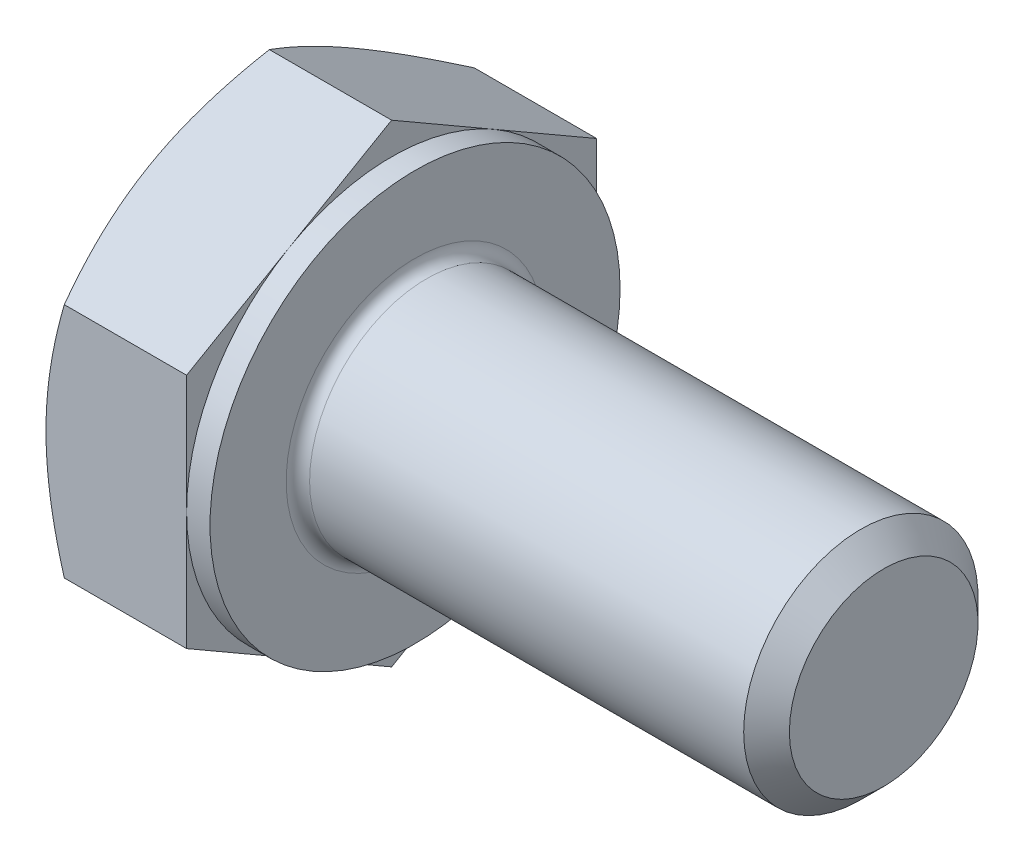
ISO-10303-21;
HEADER;
FILE_DESCRIPTION(('STEP AP214'),'2;1');
FILE_NAME('part.step','',(''),(''),'','','');
FILE_SCHEMA(('AUTOMOTIVE_DESIGN { 1 0 10303 214 1 1 1 1 }'));
ENDSEC;
DATA;
#1=APPLICATION_CONTEXT('core data for automotive mechanical design processes');
#2=APPLICATION_PROTOCOL_DEFINITION('international standard','automotive_design',2000,#1);
#3=PRODUCT_CONTEXT('',#1,'mechanical');
#4=PRODUCT('Part','Part','',(#3));
#5=PRODUCT_RELATED_PRODUCT_CATEGORY('part','',(#4));
#6=PRODUCT_DEFINITION_FORMATION('','',#4);
#7=PRODUCT_DEFINITION_CONTEXT('part definition',#1,'design');
#8=PRODUCT_DEFINITION('design','',#6,#7);
#9=PRODUCT_DEFINITION_SHAPE('','',#8);
#10=(LENGTH_UNIT() NAMED_UNIT(*) SI_UNIT(.MILLI.,.METRE.));
#11=(NAMED_UNIT(*) PLANE_ANGLE_UNIT() SI_UNIT($,.RADIAN.));
#12=(NAMED_UNIT(*) SI_UNIT($,.STERADIAN.) SOLID_ANGLE_UNIT());
#13=UNCERTAINTY_MEASURE_WITH_UNIT(LENGTH_MEASURE(1.E-05),#10,'distance_accuracy_value','');
#14=(GEOMETRIC_REPRESENTATION_CONTEXT(3) GLOBAL_UNCERTAINTY_ASSIGNED_CONTEXT((#13)) GLOBAL_UNIT_ASSIGNED_CONTEXT((#10,
#11,#12)) REPRESENTATION_CONTEXT('',''));
#15=CARTESIAN_POINT('',(0.,0.,0.));
#16=DIRECTION('',(0.,0.,1.));
#17=DIRECTION('',(1.,0.,0.));
#18=AXIS2_PLACEMENT_3D('',#15,#16,#17);
#19=CARTESIAN_POINT('',(2.8,4.04145188432738,0.));
#20=DIRECTION('',(1.,0.,0.));
#21=DIRECTION('',(0.,0.,-1.));
#22=AXIS2_PLACEMENT_3D('',#19,#20,#21);
#23=PLANE('',#22);
#24=CARTESIAN_POINT('',(2.8,0.,0.));
#25=DIRECTION('',(1.,0.,0.));
#26=DIRECTION('',(0.,0.,-1.));
#27=AXIS2_PLACEMENT_3D('',#24,#25,#26);
#28=CIRCLE('',#27,2.2);
#29=CARTESIAN_POINT('',(2.8,0.,-2.2));
#30=VERTEX_POINT('',#29);
#31=EDGE_CURVE('E42',#30,#30,#28,.F.);
#32=ORIENTED_EDGE('',*,*,#31,.T.);
#33=EDGE_LOOP('',(#32));
#34=FACE_BOUND('',#33,.T.);
#35=CARTESIAN_POINT('',(2.8,0.,0.));
#36=DIRECTION('',(1.,0.,0.));
#37=DIRECTION('',(0.,0.,-1.));
#38=AXIS2_PLACEMENT_3D('',#35,#36,#37);
#39=CIRCLE('',#38,3.5);
#40=CARTESIAN_POINT('',(2.8,0.,-3.5));
#41=VERTEX_POINT('',#40);
#42=EDGE_CURVE('E293',#41,#41,#39,.T.);
#43=ORIENTED_EDGE('',*,*,#42,.T.);
#44=EDGE_LOOP('',(#43));
#45=FACE_BOUND('',#44,.T.);
#46=ADVANCED_FACE('F34',(#34,#45),#23,.T.);
#47=CARTESIAN_POINT('',(0.,0.,0.));
#48=DIRECTION('',(-1.,0.,0.));
#49=DIRECTION('',(0.,0.,1.));
#50=AXIS2_PLACEMENT_3D('',#47,#48,#49);
#51=CYLINDRICAL_SURFACE('',#50,2.);
#52=CARTESIAN_POINT('',(3.,0.,0.));
#53=DIRECTION('',(1.,0.,0.));
#54=DIRECTION('',(0.,0.,-1.));
#55=AXIS2_PLACEMENT_3D('',#52,#53,#54);
#56=CIRCLE('',#55,2.);
#57=CARTESIAN_POINT('',(3.,0.,-2.));
#58=VERTEX_POINT('',#57);
#59=EDGE_CURVE('E11',#58,#58,#56,.T.);
#60=ORIENTED_EDGE('',*,*,#59,.T.);
#61=EDGE_LOOP('',(#60));
#62=FACE_BOUND('',#61,.T.);
#63=CARTESIAN_POINT('',(10.41,0.,0.));
#64=DIRECTION('',(-1.,0.,0.));
#65=DIRECTION('',(0.,0.,1.));
#66=AXIS2_PLACEMENT_3D('',#63,#64,#65);
#67=CIRCLE('',#66,2.);
#68=CARTESIAN_POINT('',(10.41,0.,2.));
#69=VERTEX_POINT('',#68);
#70=EDGE_CURVE('E272',#69,#69,#67,.T.);
#71=ORIENTED_EDGE('',*,*,#70,.T.);
#72=EDGE_LOOP('',(#71));
#73=FACE_BOUND('',#72,.T.);
#74=ADVANCED_FACE('F246',(#62,#73),#51,.T.);
#75=CARTESIAN_POINT('',(10.8,0.,0.));
#76=DIRECTION('',(-1.,0.,0.));
#77=DIRECTION('',(0.,0.,1.));
#78=AXIS2_PLACEMENT_3D('',#75,#76,#77);
#79=CONICAL_SURFACE('',#78,1.61,0.78539816339744);
#80=ORIENTED_EDGE('',*,*,#70,.F.);
#81=EDGE_LOOP('',(#80));
#82=FACE_BOUND('',#81,.T.);
#83=CARTESIAN_POINT('',(10.8,0.,0.));
#84=DIRECTION('',(-1.,0.,0.));
#85=DIRECTION('',(0.,0.,1.));
#86=AXIS2_PLACEMENT_3D('',#83,#84,#85);
#87=CIRCLE('',#86,1.61);
#88=CARTESIAN_POINT('',(10.8,0.,1.61));
#89=VERTEX_POINT('',#88);
#90=EDGE_CURVE('E270',#89,#89,#87,.T.);
#91=ORIENTED_EDGE('',*,*,#90,.T.);
#92=EDGE_LOOP('',(#91));
#93=FACE_BOUND('',#92,.T.);
#94=ADVANCED_FACE('F251',(#82,#93),#79,.T.);
#95=CARTESIAN_POINT('',(10.8,0.,0.));
#96=DIRECTION('',(-1.,0.,0.));
#97=DIRECTION('',(0.,0.,1.));
#98=AXIS2_PLACEMENT_3D('',#95,#96,#97);
#99=PLANE('',#98);
#100=ORIENTED_EDGE('',*,*,#90,.F.);
#101=EDGE_LOOP('',(#100));
#102=FACE_BOUND('',#101,.T.);
#103=ADVANCED_FACE('F258',(#102),#99,.F.);
#104=CARTESIAN_POINT('',(2.4,3.5,0.));
#105=DIRECTION('',(1.,0.,0.));
#106=DIRECTION('',(0.,0.,-1.));
#107=AXIS2_PLACEMENT_3D('',#104,#105,#106);
#108=PLANE('',#107);
#109=DIRECTION('',(0.,0.500000000000001,0.866025403784438));
#110=VECTOR('',#109,1.);
#111=CARTESIAN_POINT('',(2.4,2.02072594216369,-3.5));
#112=LINE('',#111,#110);
#113=CARTESIAN_POINT('',(2.4,2.02072594216369,-3.5));
#114=VERTEX_POINT('',#113);
#115=CARTESIAN_POINT('',(2.4,3.03108891324553,-1.75));
#116=VERTEX_POINT('',#115);
#117=EDGE_CURVE('E166',#114,#116,#112,.T.);
#118=ORIENTED_EDGE('',*,*,#117,.T.);
#119=CARTESIAN_POINT('',(2.4,0.,0.));
#120=DIRECTION('',(-1.,0.,0.));
#121=DIRECTION('',(0.,0.,1.));
#122=AXIS2_PLACEMENT_3D('',#119,#120,#121);
#123=CIRCLE('',#122,3.5);
#124=CARTESIAN_POINT('',(2.4,0.,-3.5));
#125=VERTEX_POINT('',#124);
#126=EDGE_CURVE('E49',#116,#125,#123,.T.);
#127=ORIENTED_EDGE('',*,*,#126,.T.);
#128=DIRECTION('',(0.,1.,0.));
#129=VECTOR('',#128,1.);
#130=CARTESIAN_POINT('',(2.4,2.02072594216369,-3.5));
#131=LINE('',#130,#129);
#132=EDGE_CURVE('E296',#125,#114,#131,.T.);
#133=ORIENTED_EDGE('',*,*,#132,.T.);
#134=EDGE_LOOP('',(#118,#127,#133));
#135=FACE_BOUND('',#134,.T.);
#136=ADVANCED_FACE('F261',(#135),#108,.T.);
#137=CARTESIAN_POINT('',(2.4,4.04145188432738,0.));
#138=VERTEX_POINT('',#137);
#139=EDGE_CURVE('E164',#116,#138,#112,.T.);
#140=ORIENTED_EDGE('',*,*,#139,.T.);
#141=DIRECTION('',(0.,-0.500000000000001,0.866025403784438));
#142=VECTOR('',#141,1.);
#143=CARTESIAN_POINT('',(2.4,4.04145188432738,0.));
#144=LINE('',#143,#142);
#145=CARTESIAN_POINT('',(2.4,3.03108891324553,1.75));
#146=VERTEX_POINT('',#145);
#147=EDGE_CURVE('E163',#138,#146,#144,.T.);
#148=ORIENTED_EDGE('',*,*,#147,.T.);
#149=EDGE_CURVE('E152',#146,#116,#123,.T.);
#150=ORIENTED_EDGE('',*,*,#149,.T.);
#151=EDGE_LOOP('',(#140,#148,#150));
#152=FACE_BOUND('',#151,.T.);
#153=ADVANCED_FACE('F266',(#152),#108,.T.);
#154=CARTESIAN_POINT('',(2.4,2.02072594216369,3.5));
#155=VERTEX_POINT('',#154);
#156=EDGE_CURVE('E131',#146,#155,#144,.T.);
#157=ORIENTED_EDGE('',*,*,#156,.T.);
#158=DIRECTION('',(0.,-1.,0.));
#159=VECTOR('',#158,1.);
#160=CARTESIAN_POINT('',(2.4,2.02072594216369,3.5));
#161=LINE('',#160,#159);
#162=CARTESIAN_POINT('',(2.4,0.,3.5));
#163=VERTEX_POINT('',#162);
#164=EDGE_CURVE('E125',#155,#163,#161,.T.);
#165=ORIENTED_EDGE('',*,*,#164,.T.);
#166=EDGE_CURVE('E129',#163,#146,#123,.T.);
#167=ORIENTED_EDGE('',*,*,#166,.T.);
#168=EDGE_LOOP('',(#157,#165,#167));
#169=FACE_BOUND('',#168,.T.);
#170=ADVANCED_FACE('F127',(#169),#108,.T.);
#171=CARTESIAN_POINT('',(2.4,-2.02072594216369,3.5));
#172=VERTEX_POINT('',#171);
#173=EDGE_CURVE('E135',#163,#172,#161,.T.);
#174=ORIENTED_EDGE('',*,*,#173,.T.);
#175=DIRECTION('',(0.,-0.500000000000002,-0.866025403784438));
#176=VECTOR('',#175,1.);
#177=CARTESIAN_POINT('',(2.4,-4.04145188432739,0.));
#178=LINE('',#177,#176);
#179=CARTESIAN_POINT('',(2.4,-3.03108891324553,1.75000000000001));
#180=VERTEX_POINT('',#179);
#181=EDGE_CURVE('E142',#172,#180,#178,.T.);
#182=ORIENTED_EDGE('',*,*,#181,.T.);
#183=EDGE_CURVE('E139',#180,#163,#123,.T.);
#184=ORIENTED_EDGE('',*,*,#183,.T.);
#185=EDGE_LOOP('',(#174,#182,#184));
#186=FACE_BOUND('',#185,.T.);
#187=ADVANCED_FACE('F140',(#186),#108,.T.);
#188=CARTESIAN_POINT('',(2.4,-4.04145188432739,0.));
#189=VERTEX_POINT('',#188);
#190=EDGE_CURVE('E158',#180,#189,#178,.T.);
#191=ORIENTED_EDGE('',*,*,#190,.T.);
#192=DIRECTION('',(0.,0.500000000000001,-0.866025403784438));
#193=VECTOR('',#192,1.);
#194=CARTESIAN_POINT('',(2.4,-2.0207259421637,-3.5));
#195=LINE('',#194,#193);
#196=CARTESIAN_POINT('',(2.4,-3.03108891324553,-1.75));
#197=VERTEX_POINT('',#196);
#198=EDGE_CURVE('E334',#189,#197,#195,.T.);
#199=ORIENTED_EDGE('',*,*,#198,.T.);
#200=EDGE_CURVE('E146',#197,#180,#123,.T.);
#201=ORIENTED_EDGE('',*,*,#200,.T.);
#202=EDGE_LOOP('',(#191,#199,#201));
#203=FACE_BOUND('',#202,.T.);
#204=ADVANCED_FACE('F335',(#203),#108,.T.);
#205=CARTESIAN_POINT('',(2.4,-2.0207259421637,-3.5));
#206=VERTEX_POINT('',#205);
#207=EDGE_CURVE('E153',#197,#206,#195,.T.);
#208=ORIENTED_EDGE('',*,*,#207,.T.);
#209=EDGE_CURVE('E297',#206,#125,#131,.T.);
#210=ORIENTED_EDGE('',*,*,#209,.T.);
#211=EDGE_CURVE('E304',#125,#197,#123,.T.);
#212=ORIENTED_EDGE('',*,*,#211,.T.);
#213=EDGE_LOOP('',(#208,#210,#212));
#214=FACE_BOUND('',#213,.T.);
#215=ADVANCED_FACE('F267',(#214),#108,.T.);
#216=CARTESIAN_POINT('',(0.,0.,0.));
#217=DIRECTION('',(-1.,0.,0.));
#218=DIRECTION('',(0.,0.,1.));
#219=AXIS2_PLACEMENT_3D('',#216,#217,#218);
#220=CYLINDRICAL_SURFACE('',#219,3.5);
#221=ORIENTED_EDGE('',*,*,#126,.F.);
#222=ORIENTED_EDGE('',*,*,#149,.F.);
#223=ORIENTED_EDGE('',*,*,#166,.F.);
#224=ORIENTED_EDGE('',*,*,#183,.F.);
#225=ORIENTED_EDGE('',*,*,#200,.F.);
#226=ORIENTED_EDGE('',*,*,#211,.F.);
#227=EDGE_LOOP('',(#221,#222,#223,#224,#225,#226));
#228=FACE_BOUND('',#227,.T.);
#229=ORIENTED_EDGE('',*,*,#42,.F.);
#230=EDGE_LOOP('',(#229));
#231=FACE_BOUND('',#230,.T.);
#232=ADVANCED_FACE('F149',(#228,#231),#220,.T.);
#233=CARTESIAN_POINT('',(0.,4.04145188432738,0.));
#234=DIRECTION('',(1.,0.,0.));
#235=DIRECTION('',(0.,0.,-1.));
#236=AXIS2_PLACEMENT_3D('',#233,#234,#235);
#237=PLANE('',#236);
#238=CARTESIAN_POINT('',(0.,0.,0.));
#239=DIRECTION('',(1.,0.,0.));
#240=DIRECTION('',(0.,0.,-1.));
#241=AXIS2_PLACEMENT_3D('',#238,#239,#240);
#242=CIRCLE('',#241,3.5);
#243=CARTESIAN_POINT('',(0.,0.,-3.5));
#244=VERTEX_POINT('',#243);
#245=CARTESIAN_POINT('',(0.,3.03108891324553,-1.75));
#246=VERTEX_POINT('',#245);
#247=EDGE_CURVE('E292',#244,#246,#242,.T.);
#248=ORIENTED_EDGE('',*,*,#247,.F.);
#249=CARTESIAN_POINT('',(0.,-3.03108891324553,-1.75));
#250=VERTEX_POINT('',#249);
#251=EDGE_CURVE('E288',#250,#244,#242,.T.);
#252=ORIENTED_EDGE('',*,*,#251,.F.);
#253=CARTESIAN_POINT('',(0.,-3.03108891324553,1.75000000000001));
#254=VERTEX_POINT('',#253);
#255=EDGE_CURVE('E291',#254,#250,#242,.T.);
#256=ORIENTED_EDGE('',*,*,#255,.F.);
#257=CARTESIAN_POINT('',(0.,0.,3.5));
#258=VERTEX_POINT('',#257);
#259=EDGE_CURVE('E327',#258,#254,#242,.T.);
#260=ORIENTED_EDGE('',*,*,#259,.F.);
#261=CARTESIAN_POINT('',(0.,0.,0.));
#262=DIRECTION('',(-1.,0.,0.));
#263=DIRECTION('',(0.,0.,1.));
#264=AXIS2_PLACEMENT_3D('',#261,#262,#263);
#265=CIRCLE('',#264,3.5);
#266=CARTESIAN_POINT('',(0.,3.03108891324553,1.75));
#267=VERTEX_POINT('',#266);
#268=EDGE_CURVE('E167',#258,#267,#265,.T.);
#269=ORIENTED_EDGE('',*,*,#268,.T.);
#270=EDGE_CURVE('E350',#246,#267,#242,.T.);
#271=ORIENTED_EDGE('',*,*,#270,.F.);
#272=EDGE_LOOP('',(#248,#252,#256,#260,#269,#271));
#273=FACE_BOUND('',#272,.T.);
#274=ADVANCED_FACE('F196',(#273),#237,.F.);
#275=CARTESIAN_POINT('',(0.,0.,0.));
#276=DIRECTION('',(1.,0.,0.));
#277=DIRECTION('',(0.,0.,-1.));
#278=AXIS2_PLACEMENT_3D('',#275,#276,#277);
#279=CONICAL_SURFACE('',#278,3.5,1.0471975511966);
#280=CARTESIAN_POINT('',(0.312674060693369,2.02061047210985,3.5002));
#281=CARTESIAN_POINT('',(0.261385788989981,2.10941108799267,3.34639282154755));
#282=CARTESIAN_POINT('',(0.214740953816195,2.19897822522909,3.19125798916558));
#283=CARTESIAN_POINT('',(0.133321875533348,2.37966345361545,2.87830199342322));
#284=CARTESIAN_POINT('',(0.0985764355845607,2.47078475532382,2.72047526921251));
#285=CARTESIAN_POINT('',(0.0444900271828356,2.65189807961073,2.40677778961987));
#286=CARTESIAN_POINT('',(0.0247890862603812,2.74186223545399,2.25095530083931));
#287=CARTESIAN_POINT('',(0.00127013273725395,2.92221386641055,1.93857711279463));
#288=CARTESIAN_POINT('',(-0.00256735545443524,3.01260068598001,1.78202254896577));
#289=CARTESIAN_POINT('',(0.00541530187697727,3.1814939814933,1.48949078007901));
#290=CARTESIAN_POINT('',(0.0152754340696068,3.26002573814993,1.3534697875421));
#291=CARTESIAN_POINT('',(0.0465264668994033,3.41657761679354,1.08231397971101));
#292=CARTESIAN_POINT('',(0.0679280432857979,3.49459719728458,0.947180102315318));
#293=CARTESIAN_POINT('',(0.121430407880577,3.65147186489429,0.675465207594817));
#294=CARTESIAN_POINT('',(0.153757994445087,3.73030709667644,0.538918580721665));
#295=CARTESIAN_POINT('',(0.227128933807994,3.88680174018324,0.267861907055499));
#296=CARTESIAN_POINT('',(0.268155046569867,3.96446315689009,0.133348387531463));
#297=CARTESIAN_POINT('',(0.312674060693371,4.04156735438122,-0.000199999999999971));
#298=B_SPLINE_CURVE_WITH_KNOTS('',3,(#280,#281,#282,#283,#284,#285,#286,#287,#288,#289,#290,
#291,#292,#293,#294,#295,#296,#297),.UNSPECIFIED.,.F.,.F.,(4,2,2,2,2,2,2,2,4),(0.,
0.554793832886253,1.11092123814984,1.65328467083219,2.19498204478403,2.6666513085086,
3.13875761298267,3.6213361260051,4.10296698719187),.UNSPECIFIED.);
#299=CARTESIAN_POINT('',(0.312607391169643,4.04145188432738,0.));
#300=VERTEX_POINT('',#299);
#301=EDGE_CURVE('E215',#267,#300,#298,.T.);
#302=ORIENTED_EDGE('',*,*,#301,.T.);
#303=CARTESIAN_POINT('',(0.312674060693371,4.04156735438122,0.0002));
#304=CARTESIAN_POINT('',(0.261385788989983,3.9527667384984,-0.15360717845245));
#305=CARTESIAN_POINT('',(0.214740953816197,3.86319960126198,-0.308742010834424));
#306=CARTESIAN_POINT('',(0.133321875533349,3.68251437287562,-0.621698006576781));
#307=CARTESIAN_POINT('',(0.0985764355845613,3.59139307116725,-0.779524730787495));
#308=CARTESIAN_POINT('',(0.0444900271828358,3.41027974688034,-1.09322221038013));
#309=CARTESIAN_POINT('',(0.024789086260381,3.32031559103708,-1.24904469916069));
#310=CARTESIAN_POINT('',(0.00127013273725357,3.13996396008051,-1.56142288720537));
#311=CARTESIAN_POINT('',(-0.00256735545443566,3.04957714051106,-1.71797745103423));
#312=CARTESIAN_POINT('',(0.00541530187697658,2.88068384499777,-2.01050921992099));
#313=CARTESIAN_POINT('',(0.0152754340696059,2.80215208834114,-2.14653021245791));
#314=CARTESIAN_POINT('',(0.046526466899402,2.64560020969753,-2.41768602028899));
#315=CARTESIAN_POINT('',(0.0679280432857964,2.56758062920649,-2.55281989768468));
#316=CARTESIAN_POINT('',(0.121430407880575,2.41070596159678,-2.82453479240518));
#317=CARTESIAN_POINT('',(0.153757994445085,2.33187072981463,-2.96108141927833));
#318=CARTESIAN_POINT('',(0.227128933807992,2.17537608630783,-3.2321380929445));
#319=CARTESIAN_POINT('',(0.268155046569864,2.09771466960098,-3.36665161246854));
#320=CARTESIAN_POINT('',(0.312674060693368,2.02061047210985,-3.5002));
#321=B_SPLINE_CURVE_WITH_KNOTS('',3,(#303,#304,#305,#306,#307,#308,#309,#310,#311,#312,#313,
#314,#315,#316,#317,#318,#319,#320),.UNSPECIFIED.,.F.,.F.,(4,2,2,2,2,2,2,2,4),(0.,
0.554793832886254,1.11092123814984,1.65328467083219,2.19498204478403,2.6666513085086,
3.13875761298267,3.6213361260051,4.10296698719187),.UNSPECIFIED.);
#322=EDGE_CURVE('E57',#300,#246,#321,.T.);
#323=ORIENTED_EDGE('',*,*,#322,.T.);
#324=ORIENTED_EDGE('',*,*,#270,.T.);
#325=EDGE_LOOP('',(#302,#323,#324));
#326=FACE_BOUND('',#325,.T.);
#327=ADVANCED_FACE('F351',(#326),#279,.T.);
#328=CARTESIAN_POINT('',(1.74876972324083,-5.51155991662166,3.5));
#329=CARTESIAN_POINT('',(1.67392336064349,-5.35795146497442,3.5));
#330=CARTESIAN_POINT('',(1.59977092634846,-5.20399921327067,3.5));
#331=CARTESIAN_POINT('',(1.45324265223558,-4.89522455167779,3.5));
#332=CARTESIAN_POINT('',(1.38086707701141,-4.74040201636207,3.5));
#333=CARTESIAN_POINT('',(1.23793493399994,-4.42894615294239,3.5));
#334=CARTESIAN_POINT('',(1.1673897119315,-4.27230760071021,3.5));
#335=CARTESIAN_POINT('',(1.02907715201446,-3.95781335407224,3.5));
#336=CARTESIAN_POINT('',(0.961309688205796,-3.7999577152429,3.5));
#337=CARTESIAN_POINT('',(0.827049258068261,-3.47741113342679,3.5));
#338=CARTESIAN_POINT('',(0.760677040301389,-3.31266966191409,3.5));
#339=CARTESIAN_POINT('',(0.632756391222597,-2.98129055334351,3.5));
#340=CARTESIAN_POINT('',(0.571208489240967,-2.81465271050397,3.5));
#341=CARTESIAN_POINT('',(0.454490935593629,-2.47950135142084,3.5));
#342=CARTESIAN_POINT('',(0.399309072522246,-2.31099212961239,3.5));
#343=CARTESIAN_POINT('',(0.297038623207366,-1.97155788075463,3.5));
#344=CARTESIAN_POINT('',(0.249947575461081,-1.80063360563482,3.5));
#345=CARTESIAN_POINT('',(0.166312731904445,-1.4572176944235,3.5));
#346=CARTESIAN_POINT('',(0.129709932809729,-1.28474069132431,3.5));
#347=CARTESIAN_POINT('',(0.0690664437905969,-0.937557024710311,3.5));
#348=CARTESIAN_POINT('',(0.0450243877823822,-0.762850605780835,3.5));
#349=CARTESIAN_POINT('',(0.0117307990577603,-0.414396255839318,3.5));
#350=CARTESIAN_POINT('',(0.0022826057682421,-0.240667591359056,3.5));
#351=CARTESIAN_POINT('',(-0.00154556657178763,0.106974361978122,3.5));
#352=CARTESIAN_POINT('',(0.00407467653682717,0.280887653519269,3.5));
#353=CARTESIAN_POINT('',(0.0258160056757245,0.573677732069629,3.5));
#354=CARTESIAN_POINT('',(0.0381294865222876,0.692856455403481,3.5));
#355=CARTESIAN_POINT('',(0.0691104276210837,0.930390572672186,3.5));
#356=CARTESIAN_POINT('',(0.0877786805228842,1.04874586201749,3.5));
#357=CARTESIAN_POINT('',(0.152339395828374,1.40238821330866,3.5));
#358=CARTESIAN_POINT('',(0.206777964761844,1.63613518289362,3.5));
#359=CARTESIAN_POINT('',(0.301818253779738,1.98584040996061,3.5));
#360=CARTESIAN_POINT('',(0.336200478121236,2.10359260845122,3.5));
#361=CARTESIAN_POINT('',(0.408694226179533,2.33795453185625,3.5));
#362=CARTESIAN_POINT('',(0.44680577866419,2.45456424794998,3.5));
#363=CARTESIAN_POINT('',(0.526133501179596,2.68667648799219,3.5));
#364=CARTESIAN_POINT('',(0.567348797905205,2.80217931315365,3.5));
#365=CARTESIAN_POINT('',(0.652383319257558,3.03221622488003,3.5));
#366=CARTESIAN_POINT('',(0.696202484064565,3.14675033363066,3.5));
#367=CARTESIAN_POINT('',(0.817586420524254,3.45518824791986,3.5));
#368=CARTESIAN_POINT('',(0.897216284270027,3.64827858653487,3.5));
#369=CARTESIAN_POINT('',(1.06116121789353,4.03246734047174,3.5));
#370=CARTESIAN_POINT('',(1.14547680977311,4.22356553103577,3.5));
#371=CARTESIAN_POINT('',(1.31768022516433,4.60422080385887,3.5));
#372=CARTESIAN_POINT('',(1.40556928969842,4.79377732281037,3.5));
#373=CARTESIAN_POINT('',(1.5840729434937,5.17160543290685,3.5));
#374=CARTESIAN_POINT('',(1.67468761675268,5.35987698423189,3.5));
#375=CARTESIAN_POINT('',(1.85818750995007,5.73567568482784,3.5));
#376=CARTESIAN_POINT('',(1.95107608308063,5.92320119337956,3.5));
#377=CARTESIAN_POINT('',(2.13854805180964,6.29740401627919,3.5));
#378=CARTESIAN_POINT('',(2.23313146548459,6.48408132155384,3.5));
#379=CARTESIAN_POINT('',(2.51886265052555,7.04299370869451,3.5));
#380=CARTESIAN_POINT('',(2.71203324279836,7.41419418882235,3.5));
#381=CARTESIAN_POINT('',(3.08131090922903,8.11545297659331,3.5));
#382=CARTESIAN_POINT('',(3.257056800529,8.44570240889787,3.5));
#383=CARTESIAN_POINT('',(3.61066708174042,9.10509095555402,3.5));
#384=CARTESIAN_POINT('',(3.78853160254258,9.43422999967597,3.5));
#385=CARTESIAN_POINT('',(4.14522643287858,10.0905480477554,3.5));
#386=CARTESIAN_POINT('',(4.32405147354835,10.4177299197431,3.5));
#387=CARTESIAN_POINT('',(4.68290305461308,11.0714005829853,3.5));
#388=CARTESIAN_POINT('',(4.86292949853349,11.3978894271807,3.5));
#389=CARTESIAN_POINT('',(5.04339321876768,11.7241348746726,3.5));
#390=B_SPLINE_CURVE_WITH_KNOTS('',3,(#328,#329,#330,#331,#332,#333,#334,#335,#336,#337,#338,
#339,#340,#341,#342,#343,#344,#345,#346,#347,#348,#349,#350,#351,#352,#353,#354,#355,#356,#357,
#358,#359,#360,#361,#362,#363,#364,#365,#366,#367,#368,#369,#370,#371,#372,#373,#374,#375,#376,
#377,#378,#379,#380,#381,#382,#383,#384,#385,#386,#387,#388,#389),.UNSPECIFIED.,.F.,.F.,(4,2,2,
2,2,2,2,2,2,2,2,2,2,2,2,2,2,2,2,2,2,2,2,2,2,2,2,2,2,2,4),(0.,0.512624455455558,1.02532478887103,
1.54067716699584,2.05600615007007,2.58877526866933,3.12160276180877,3.65339055960882,
4.18501628177853,4.71358975001966,5.24210571958898,5.76343550668359,6.28477297996432,
6.64403977825953,7.00335140539848,7.72232402673615,8.09029790450666,8.45827462103385,
8.82614818350626,9.19401329793224,9.82051720822946,10.4470910530887,11.0738843896344,
11.7006970625238,12.3284975533834,12.9563047441025,14.211635085947,15.33392926628,
16.4562931462709,17.574877685398,18.6933734561263),.UNSPECIFIED.);
#391=CARTESIAN_POINT('',(0.312607391169641,2.02072594216369,3.5));
#392=VERTEX_POINT('',#391);
#393=EDGE_CURVE('E227',#258,#392,#390,.T.);
#394=ORIENTED_EDGE('',*,*,#393,.T.);
#395=EDGE_CURVE('E226',#392,#267,#298,.T.);
#396=ORIENTED_EDGE('',*,*,#395,.T.);
#397=ORIENTED_EDGE('',*,*,#268,.F.);
#398=EDGE_LOOP('',(#394,#396,#397));
#399=FACE_BOUND('',#398,.T.);
#400=ADVANCED_FACE('F321',(#399),#279,.T.);
#401=CARTESIAN_POINT('',(0.312607391169641,-2.02072594216369,3.5));
#402=VERTEX_POINT('',#401);
#403=EDGE_CURVE('E273',#402,#258,#390,.T.);
#404=ORIENTED_EDGE('',*,*,#403,.T.);
#405=ORIENTED_EDGE('',*,*,#259,.T.);
#406=CARTESIAN_POINT('',(0.312674060693374,-4.04156735438123,-0.000200000000000053));
#407=CARTESIAN_POINT('',(0.261385788989987,-3.95276673849841,0.15360717845245));
#408=CARTESIAN_POINT('',(0.2147409538162,-3.86319960126199,0.308742010834424));
#409=CARTESIAN_POINT('',(0.133321875533352,-3.68251437287563,0.621698006576782));
#410=CARTESIAN_POINT('',(0.0985764355845642,-3.59139307116725,0.779524730787496));
#411=CARTESIAN_POINT('',(0.0444900271828384,-3.41027974688034,1.09322221038013));
#412=CARTESIAN_POINT('',(0.0247890862603835,-3.32031559103708,1.24904469916069));
#413=CARTESIAN_POINT('',(0.00127013273725588,-3.13996396008052,1.56142288720537));
#414=CARTESIAN_POINT('',(-0.00256735545443333,-3.04957714051106,1.71797745103423));
#415=CARTESIAN_POINT('',(0.00541530187697865,-2.88068384499778,2.01050921992099));
#416=CARTESIAN_POINT('',(0.0152754340696077,-2.80215208834115,2.14653021245791));
#417=CARTESIAN_POINT('',(0.0465264668994037,-2.64560020969753,2.417686020289));
#418=CARTESIAN_POINT('',(0.0679280432857982,-2.5675806292065,2.55281989768468));
#419=CARTESIAN_POINT('',(0.121430407880577,-2.41070596159678,2.82453479240518));
#420=CARTESIAN_POINT('',(0.153757994445086,-2.33187072981463,2.96108141927834));
#421=CARTESIAN_POINT('',(0.227128933807993,-2.17537608630783,3.2321380929445));
#422=CARTESIAN_POINT('',(0.268155046569865,-2.09771466960098,3.36665161246854));
#423=CARTESIAN_POINT('',(0.312674060693369,-2.02061047210985,3.5002));
#424=B_SPLINE_CURVE_WITH_KNOTS('',3,(#406,#407,#408,#409,#410,#411,#412,#413,#414,#415,#416,
#417,#418,#419,#420,#421,#422,#423),.UNSPECIFIED.,.F.,.F.,(4,2,2,2,2,2,2,2,4),(0.,
0.554793832886255,1.11092123814984,1.65328467083219,2.19498204478403,2.6666513085086,
3.13875761298268,3.6213361260051,4.10296698719188),.UNSPECIFIED.);
#425=EDGE_CURVE('E217',#254,#402,#424,.T.);
#426=ORIENTED_EDGE('',*,*,#425,.T.);
#427=EDGE_LOOP('',(#404,#405,#426));
#428=FACE_BOUND('',#427,.T.);
#429=ADVANCED_FACE('F185',(#428),#279,.T.);
#430=CARTESIAN_POINT('',(0.312607391169646,-4.04145188432739,0.));
#431=VERTEX_POINT('',#430);
#432=EDGE_CURVE('E210',#431,#254,#424,.T.);
#433=ORIENTED_EDGE('',*,*,#432,.T.);
#434=ORIENTED_EDGE('',*,*,#255,.T.);
#435=CARTESIAN_POINT('',(0.312674060693371,-2.02061047210986,-3.5002));
#436=CARTESIAN_POINT('',(0.261385788989984,-2.10941108799268,-3.34639282154755));
#437=CARTESIAN_POINT('',(0.214740953816197,-2.1989782252291,-3.19125798916558));
#438=CARTESIAN_POINT('',(0.13332187553335,-2.37966345361545,-2.87830199342322));
#439=CARTESIAN_POINT('',(0.0985764355845629,-2.47078475532383,-2.7204752692125));
#440=CARTESIAN_POINT('',(0.0444900271828382,-2.65189807961074,-2.40677778961987));
#441=CARTESIAN_POINT('',(0.0247890862603841,-2.741862235454,-2.25095530083931));
#442=CARTESIAN_POINT('',(0.00127013273725731,-2.92221386641056,-1.93857711279463));
#443=CARTESIAN_POINT('',(-0.00256735545443173,-3.01260068598002,-1.78202254896577));
#444=CARTESIAN_POINT('',(0.00541530187698112,-3.1814939814933,-1.48949078007901));
#445=CARTESIAN_POINT('',(0.0152754340696108,-3.26002573814993,-1.35346978754209));
#446=CARTESIAN_POINT('',(0.0465264668994074,-3.41657761679354,-1.08231397971101));
#447=CARTESIAN_POINT('',(0.0679280432858019,-3.49459719728458,-0.947180102315317));
#448=CARTESIAN_POINT('',(0.121430407880581,-3.65147186489429,-0.675465207594816));
#449=CARTESIAN_POINT('',(0.15375799444509,-3.73030709667644,-0.538918580721665));
#450=CARTESIAN_POINT('',(0.227128933807998,-3.88680174018325,-0.267861907055498));
#451=CARTESIAN_POINT('',(0.26815504656987,-3.9644631568901,-0.133348387531463));
#452=CARTESIAN_POINT('',(0.312674060693374,-4.04156735438123,0.000200000000000085));
#453=B_SPLINE_CURVE_WITH_KNOTS('',3,(#435,#436,#437,#438,#439,#440,#441,#442,#443,#444,#445,
#446,#447,#448,#449,#450,#451,#452),.UNSPECIFIED.,.F.,.F.,(4,2,2,2,2,2,2,2,4),(0.,
0.554793832886254,1.11092123814984,1.65328467083219,2.19498204478403,2.6666513085086,
3.13875761298267,3.6213361260051,4.10296698719187),.UNSPECIFIED.);
#454=EDGE_CURVE('E216',#250,#431,#453,.T.);
#455=ORIENTED_EDGE('',*,*,#454,.T.);
#456=EDGE_LOOP('',(#433,#434,#455));
#457=FACE_BOUND('',#456,.T.);
#458=ADVANCED_FACE('F349',(#457),#279,.T.);
#459=CARTESIAN_POINT('',(0.31260739116964,2.02072594216369,-3.5));
#460=VERTEX_POINT('',#459);
#461=EDGE_CURVE('E218',#246,#460,#321,.T.);
#462=ORIENTED_EDGE('',*,*,#461,.T.);
#463=CARTESIAN_POINT('',(1.74876972324083,-5.51155991662167,-3.5));
#464=CARTESIAN_POINT('',(1.6739233606435,-5.35795146497443,-3.5));
#465=CARTESIAN_POINT('',(1.59977092634847,-5.20399921327068,-3.5));
#466=CARTESIAN_POINT('',(1.45324265223558,-4.8952245516778,-3.5));
#467=CARTESIAN_POINT('',(1.38086707701141,-4.74040201636208,-3.5));
#468=CARTESIAN_POINT('',(1.23793493399994,-4.4289461529424,-3.5));
#469=CARTESIAN_POINT('',(1.1673897119315,-4.27230760071022,-3.5));
#470=CARTESIAN_POINT('',(1.02907715201446,-3.95781335407225,-3.5));
#471=CARTESIAN_POINT('',(0.9613096882058,-3.79995771524291,-3.5));
#472=CARTESIAN_POINT('',(0.827049258068264,-3.4774111334268,-3.5));
#473=CARTESIAN_POINT('',(0.760677040301392,-3.3126696619141,-3.5));
#474=CARTESIAN_POINT('',(0.6327563912226,-2.98129055334351,-3.5));
#475=CARTESIAN_POINT('',(0.57120848924097,-2.81465271050398,-3.5));
#476=CARTESIAN_POINT('',(0.454490935593631,-2.47950135142084,-3.5));
#477=CARTESIAN_POINT('',(0.399309072522248,-2.3109921296124,-3.5));
#478=CARTESIAN_POINT('',(0.297038623207368,-1.97155788075463,-3.5));
#479=CARTESIAN_POINT('',(0.249947575461083,-1.80063360563483,-3.5));
#480=CARTESIAN_POINT('',(0.166312731904446,-1.45721769442351,-3.5));
#481=CARTESIAN_POINT('',(0.129709932809731,-1.28474069132431,-3.5));
#482=CARTESIAN_POINT('',(0.069066443790598,-0.937557024710318,-3.5));
#483=CARTESIAN_POINT('',(0.0450243877823832,-0.762850605780842,-3.5));
#484=CARTESIAN_POINT('',(0.0117307990577608,-0.414396255839325,-3.5));
#485=CARTESIAN_POINT('',(0.00228260576824228,-0.240667591359062,-3.5));
#486=CARTESIAN_POINT('',(-0.00154556657178782,0.106974361978116,-3.5));
#487=CARTESIAN_POINT('',(0.00407467653682695,0.280887653519263,-3.5));
#488=CARTESIAN_POINT('',(0.0258160056757238,0.573677732069623,-3.5));
#489=CARTESIAN_POINT('',(0.0381294865222865,0.692856455403475,-3.5));
#490=CARTESIAN_POINT('',(0.0691104276210824,0.93039057267218,-3.5));
#491=CARTESIAN_POINT('',(0.0877786805228829,1.04874586201748,-3.5));
#492=CARTESIAN_POINT('',(0.152339395828372,1.40238821330865,-3.5));
#493=CARTESIAN_POINT('',(0.206777964761842,1.63613518289362,-3.5));
#494=CARTESIAN_POINT('',(0.301818253779736,1.9858404099606,-3.5));
#495=CARTESIAN_POINT('',(0.336200478121233,2.10359260845122,-3.5));
#496=CARTESIAN_POINT('',(0.40869422617953,2.33795453185625,-3.5));
#497=CARTESIAN_POINT('',(0.446805778664187,2.45456424794997,-3.5));
#498=CARTESIAN_POINT('',(0.526133501179593,2.68667648799218,-3.5));
#499=CARTESIAN_POINT('',(0.567348797905202,2.80217931315365,-3.5));
#500=CARTESIAN_POINT('',(0.652383319257555,3.03221622488002,-3.5));
#501=CARTESIAN_POINT('',(0.696202484064561,3.14675033363065,-3.5));
#502=CARTESIAN_POINT('',(0.817586420524251,3.45518824791985,-3.5));
#503=CARTESIAN_POINT('',(0.897216284270023,3.64827858653487,-3.5));
#504=CARTESIAN_POINT('',(1.06116121789352,4.03246734047173,-3.5));
#505=CARTESIAN_POINT('',(1.1454768097731,4.22356553103576,-3.5));
#506=CARTESIAN_POINT('',(1.31768022516433,4.60422080385887,-3.5));
#507=CARTESIAN_POINT('',(1.40556928969842,4.79377732281036,-3.5));
#508=CARTESIAN_POINT('',(1.5840729434937,5.17160543290685,-3.5));
#509=CARTESIAN_POINT('',(1.67468761675268,5.35987698423189,-3.5));
#510=CARTESIAN_POINT('',(1.85818750995007,5.73567568482784,-3.5));
#511=CARTESIAN_POINT('',(1.95107608308063,5.92320119337956,-3.5));
#512=CARTESIAN_POINT('',(2.13854805180964,6.29740401627919,-3.5));
#513=CARTESIAN_POINT('',(2.23313146548459,6.48408132155384,-3.5));
#514=CARTESIAN_POINT('',(2.51886265052555,7.04299370869452,-3.5));
#515=CARTESIAN_POINT('',(2.71203324279836,7.41419418882236,-3.5));
#516=CARTESIAN_POINT('',(3.08131090922904,8.11545297659332,-3.5));
#517=CARTESIAN_POINT('',(3.257056800529,8.44570240889787,-3.5));
#518=CARTESIAN_POINT('',(3.61066708174042,9.10509095555402,-3.5));
#519=CARTESIAN_POINT('',(3.78853160254258,9.43422999967597,-3.5));
#520=CARTESIAN_POINT('',(4.14522643287858,10.0905480477554,-3.5));
#521=CARTESIAN_POINT('',(4.32405147354835,10.4177299197431,-3.5));
#522=CARTESIAN_POINT('',(4.68290305461308,11.0714005829853,-3.5));
#523=CARTESIAN_POINT('',(4.86292949853349,11.3978894271807,-3.5));
#524=CARTESIAN_POINT('',(5.04339321876768,11.7241348746726,-3.5));
#525=B_SPLINE_CURVE_WITH_KNOTS('',3,(#463,#464,#465,#466,#467,#468,#469,#470,#471,#472,#473,
#474,#475,#476,#477,#478,#479,#480,#481,#482,#483,#484,#485,#486,#487,#488,#489,#490,#491,#492,
#493,#494,#495,#496,#497,#498,#499,#500,#501,#502,#503,#504,#505,#506,#507,#508,#509,#510,#511,
#512,#513,#514,#515,#516,#517,#518,#519,#520,#521,#522,#523,#524),.UNSPECIFIED.,.F.,.F.,(4,2,2,
2,2,2,2,2,2,2,2,2,2,2,2,2,2,2,2,2,2,2,2,2,2,2,2,2,2,2,4),(0.,0.512624455455557,1.02532478887103,
1.54067716699584,2.05600615007007,2.58877526866933,3.12160276180877,3.65339055960882,
4.18501628177853,4.71358975001966,5.24210571958899,5.76343550668359,6.28477297996432,
6.64403977825953,7.00335140539848,7.72232402673615,8.09029790450666,8.45827462103385,
8.82614818350626,9.19401329793224,9.82051720822946,10.4470910530887,11.0738843896344,
11.7006970625238,12.3284975533834,12.9563047441025,14.211635085947,15.3339292662801,
16.4562931462709,17.574877685398,18.6933734561263),.UNSPECIFIED.);
#526=EDGE_CURVE('E178',#460,#244,#525,.F.);
#527=ORIENTED_EDGE('',*,*,#526,.T.);
#528=ORIENTED_EDGE('',*,*,#247,.T.);
#529=EDGE_LOOP('',(#462,#527,#528));
#530=FACE_BOUND('',#529,.T.);
#531=ADVANCED_FACE('F346',(#530),#279,.T.);
#532=CARTESIAN_POINT('',(0.312607391169535,-2.02072594216386,-3.5));
#533=VERTEX_POINT('',#532);
#534=EDGE_CURVE('E179',#533,#250,#453,.T.);
#535=ORIENTED_EDGE('',*,*,#534,.T.);
#536=ORIENTED_EDGE('',*,*,#251,.T.);
#537=EDGE_CURVE('E170',#244,#533,#525,.F.);
#538=ORIENTED_EDGE('',*,*,#537,.T.);
#539=EDGE_LOOP('',(#535,#536,#538));
#540=FACE_BOUND('',#539,.T.);
#541=ADVANCED_FACE('F194',(#540),#279,.T.);
#542=CARTESIAN_POINT('',(2.8,2.02072594216369,-3.5));
#543=DIRECTION('',(0.,0.,1.));
#544=DIRECTION('',(0.,-1.,0.));
#545=AXIS2_PLACEMENT_3D('',#542,#543,#544);
#546=PLANE('',#545);
#547=ORIENTED_EDGE('',*,*,#209,.F.);
#548=DIRECTION('',(-1.,0.,0.));
#549=VECTOR('',#548,1.);
#550=CARTESIAN_POINT('',(2.8,-2.0207259421637,-3.5));
#551=LINE('',#550,#549);
#552=EDGE_CURVE('E279',#206,#533,#551,.T.);
#553=ORIENTED_EDGE('',*,*,#552,.T.);
#554=ORIENTED_EDGE('',*,*,#537,.F.);
#555=ORIENTED_EDGE('',*,*,#526,.F.);
#556=DIRECTION('',(-1.,0.,0.));
#557=VECTOR('',#556,1.);
#558=CARTESIAN_POINT('',(2.8,2.02072594216369,-3.5));
#559=LINE('',#558,#557);
#560=EDGE_CURVE('E275',#114,#460,#559,.T.);
#561=ORIENTED_EDGE('',*,*,#560,.F.);
#562=ORIENTED_EDGE('',*,*,#132,.F.);
#563=EDGE_LOOP('',(#547,#553,#554,#555,#561,#562));
#564=FACE_BOUND('',#563,.T.);
#565=ADVANCED_FACE('F189',(#564),#546,.F.);
#566=CARTESIAN_POINT('',(2.8,-2.0207259421637,-3.5));
#567=DIRECTION('',(0.,0.866025403784438,0.500000000000001));
#568=DIRECTION('',(0.,-0.500000000000001,0.866025403784438));
#569=AXIS2_PLACEMENT_3D('',#566,#567,#568);
#570=PLANE('',#569);
#571=ORIENTED_EDGE('',*,*,#198,.F.);
#572=DIRECTION('',(-1.,0.,0.));
#573=VECTOR('',#572,1.);
#574=CARTESIAN_POINT('',(2.8,-4.04145188432739,0.));
#575=LINE('',#574,#573);
#576=EDGE_CURVE('E281',#189,#431,#575,.T.);
#577=ORIENTED_EDGE('',*,*,#576,.T.);
#578=ORIENTED_EDGE('',*,*,#454,.F.);
#579=ORIENTED_EDGE('',*,*,#534,.F.);
#580=ORIENTED_EDGE('',*,*,#552,.F.);
#581=ORIENTED_EDGE('',*,*,#207,.F.);
#582=EDGE_LOOP('',(#571,#577,#578,#579,#580,#581));
#583=FACE_BOUND('',#582,.T.);
#584=ADVANCED_FACE('F193',(#583),#570,.F.);
#585=CARTESIAN_POINT('',(2.8,-4.04145188432739,0.));
#586=DIRECTION('',(0.,0.866025403784438,-0.500000000000002));
#587=DIRECTION('',(0.,0.500000000000002,0.866025403784438));
#588=AXIS2_PLACEMENT_3D('',#585,#586,#587);
#589=PLANE('',#588);
#590=ORIENTED_EDGE('',*,*,#181,.F.);
#591=DIRECTION('',(-1.,0.,0.));
#592=VECTOR('',#591,1.);
#593=CARTESIAN_POINT('',(2.8,-2.02072594216369,3.5));
#594=LINE('',#593,#592);
#595=EDGE_CURVE('E157',#172,#402,#594,.T.);
#596=ORIENTED_EDGE('',*,*,#595,.T.);
#597=ORIENTED_EDGE('',*,*,#425,.F.);
#598=ORIENTED_EDGE('',*,*,#432,.F.);
#599=ORIENTED_EDGE('',*,*,#576,.F.);
#600=ORIENTED_EDGE('',*,*,#190,.F.);
#601=EDGE_LOOP('',(#590,#596,#597,#598,#599,#600));
#602=FACE_BOUND('',#601,.T.);
#603=ADVANCED_FACE('F201',(#602),#589,.F.);
#604=CARTESIAN_POINT('',(2.8,2.02072594216369,3.5));
#605=DIRECTION('',(0.,0.,-1.));
#606=DIRECTION('',(0.,1.,0.));
#607=AXIS2_PLACEMENT_3D('',#604,#605,#606);
#608=PLANE('',#607);
#609=ORIENTED_EDGE('',*,*,#164,.F.);
#610=DIRECTION('',(-1.,0.,0.));
#611=VECTOR('',#610,1.);
#612=CARTESIAN_POINT('',(2.8,2.02072594216369,3.5));
#613=LINE('',#612,#611);
#614=EDGE_CURVE('E284',#155,#392,#613,.T.);
#615=ORIENTED_EDGE('',*,*,#614,.T.);
#616=ORIENTED_EDGE('',*,*,#393,.F.);
#617=ORIENTED_EDGE('',*,*,#403,.F.);
#618=ORIENTED_EDGE('',*,*,#595,.F.);
#619=ORIENTED_EDGE('',*,*,#173,.F.);
#620=EDGE_LOOP('',(#609,#615,#616,#617,#618,#619));
#621=FACE_BOUND('',#620,.T.);
#622=ADVANCED_FACE('F155',(#621),#608,.F.);
#623=CARTESIAN_POINT('',(2.8,4.04145188432738,0.));
#624=DIRECTION('',(0.,-0.866025403784438,-0.500000000000001));
#625=DIRECTION('',(0.,0.500000000000001,-0.866025403784438));
#626=AXIS2_PLACEMENT_3D('',#623,#624,#625);
#627=PLANE('',#626);
#628=ORIENTED_EDGE('',*,*,#147,.F.);
#629=DIRECTION('',(-1.,0.,0.));
#630=VECTOR('',#629,1.);
#631=CARTESIAN_POINT('',(2.8,4.04145188432738,0.));
#632=LINE('',#631,#630);
#633=EDGE_CURVE('E286',#138,#300,#632,.T.);
#634=ORIENTED_EDGE('',*,*,#633,.T.);
#635=ORIENTED_EDGE('',*,*,#301,.F.);
#636=ORIENTED_EDGE('',*,*,#395,.F.);
#637=ORIENTED_EDGE('',*,*,#614,.F.);
#638=ORIENTED_EDGE('',*,*,#156,.F.);
#639=EDGE_LOOP('',(#628,#634,#635,#636,#637,#638));
#640=FACE_BOUND('',#639,.T.);
#641=ADVANCED_FACE('F232',(#640),#627,.F.);
#642=CARTESIAN_POINT('',(2.8,2.02072594216369,-3.5));
#643=DIRECTION('',(0.,-0.866025403784438,0.500000000000001));
#644=DIRECTION('',(0.,-0.500000000000001,-0.866025403784438));
#645=AXIS2_PLACEMENT_3D('',#642,#643,#644);
#646=PLANE('',#645);
#647=ORIENTED_EDGE('',*,*,#117,.F.);
#648=ORIENTED_EDGE('',*,*,#560,.T.);
#649=ORIENTED_EDGE('',*,*,#461,.F.);
#650=ORIENTED_EDGE('',*,*,#322,.F.);
#651=ORIENTED_EDGE('',*,*,#633,.F.);
#652=ORIENTED_EDGE('',*,*,#139,.F.);
#653=EDGE_LOOP('',(#647,#648,#649,#650,#651,#652));
#654=FACE_BOUND('',#653,.T.);
#655=ADVANCED_FACE('F235',(#654),#646,.F.);
#656=CARTESIAN_POINT('',(3.,0.,0.));
#657=DIRECTION('',(1.,0.,0.));
#658=DIRECTION('',(0.,0.,-1.));
#659=AXIS2_PLACEMENT_3D('',#656,#657,#658);
#660=TOROIDAL_SURFACE('',#659,2.2,0.2);
#661=ORIENTED_EDGE('',*,*,#59,.F.);
#662=EDGE_LOOP('',(#661));
#663=FACE_BOUND('',#662,.T.);
#664=ORIENTED_EDGE('',*,*,#31,.F.);
#665=EDGE_LOOP('',(#664));
#666=FACE_BOUND('',#665,.T.);
#667=ADVANCED_FACE('F36',(#663,#666),#660,.F.);
#668=CLOSED_SHELL('',(#46,#74,#94,#103,#136,#153,#170,#187,#204,#215,#232,#274,#327,#400,#429,
#458,#531,#541,#565,#584,#603,#622,#641,#655,#667));
#669=MANIFOLD_SOLID_BREP('B2',#668);
#670=ADVANCED_BREP_SHAPE_REPRESENTATION('',(#18,#669),#14);
#671=SHAPE_DEFINITION_REPRESENTATION(#9,#670);
ENDSEC;
END-ISO-10303-21;
